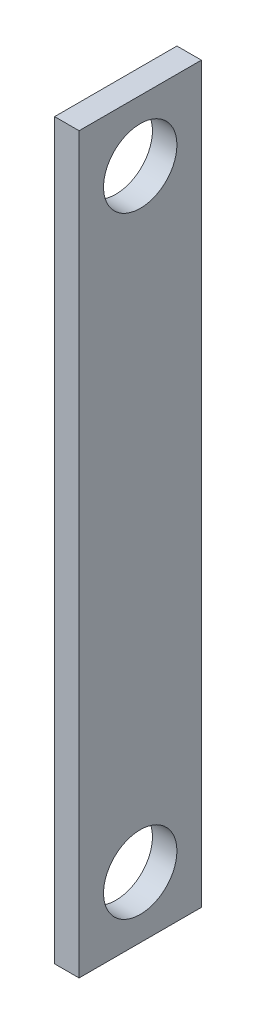
ISO-10303-21;
HEADER;
FILE_DESCRIPTION(('STEP AP214'),'2;1');
FILE_NAME('part.step','',(''),(''),'','','');
FILE_SCHEMA(('AUTOMOTIVE_DESIGN { 1 0 10303 214 1 1 1 1 }'));
ENDSEC;
DATA;
#1=APPLICATION_CONTEXT('core data for automotive mechanical design processes');
#2=APPLICATION_PROTOCOL_DEFINITION('international standard','automotive_design',2000,#1);
#3=PRODUCT_CONTEXT('',#1,'mechanical');
#4=PRODUCT('Part','Part','',(#3));
#5=PRODUCT_RELATED_PRODUCT_CATEGORY('part','',(#4));
#6=PRODUCT_DEFINITION_FORMATION('','',#4);
#7=PRODUCT_DEFINITION_CONTEXT('part definition',#1,'design');
#8=PRODUCT_DEFINITION('design','',#6,#7);
#9=PRODUCT_DEFINITION_SHAPE('','',#8);
#10=(LENGTH_UNIT() NAMED_UNIT(*) SI_UNIT(.MILLI.,.METRE.));
#11=(NAMED_UNIT(*) PLANE_ANGLE_UNIT() SI_UNIT($,.RADIAN.));
#12=(NAMED_UNIT(*) SI_UNIT($,.STERADIAN.) SOLID_ANGLE_UNIT());
#13=UNCERTAINTY_MEASURE_WITH_UNIT(LENGTH_MEASURE(1.E-05),#10,'distance_accuracy_value','');
#14=(GEOMETRIC_REPRESENTATION_CONTEXT(3) GLOBAL_UNCERTAINTY_ASSIGNED_CONTEXT((#13)) GLOBAL_UNIT_ASSIGNED_CONTEXT((#10,
#11,#12)) REPRESENTATION_CONTEXT('',''));
#15=CARTESIAN_POINT('',(0.,0.,0.));
#16=DIRECTION('',(0.,0.,1.));
#17=DIRECTION('',(1.,0.,0.));
#18=AXIS2_PLACEMENT_3D('',#15,#16,#17);
#19=CARTESIAN_POINT('',(2.,-30.,-5.));
#20=DIRECTION('',(0.,0.,1.));
#21=DIRECTION('',(1.,0.,0.));
#22=AXIS2_PLACEMENT_3D('',#19,#20,#21);
#23=PLANE('',#22);
#24=DIRECTION('',(0.,1.,0.));
#25=VECTOR('',#24,1.);
#26=CARTESIAN_POINT('',(0.,-30.,-5.));
#27=LINE('',#26,#25);
#28=CARTESIAN_POINT('',(0.,-30.,-5.));
#29=VERTEX_POINT('',#28);
#30=CARTESIAN_POINT('',(0.,30.,-5.));
#31=VERTEX_POINT('',#30);
#32=EDGE_CURVE('E96',#29,#31,#27,.T.);
#33=ORIENTED_EDGE('',*,*,#32,.T.);
#34=DIRECTION('',(-1.,0.,0.));
#35=VECTOR('',#34,1.);
#36=CARTESIAN_POINT('',(2.,30.,-5.));
#37=LINE('',#36,#35);
#38=CARTESIAN_POINT('',(2.,30.,-5.));
#39=VERTEX_POINT('',#38);
#40=EDGE_CURVE('E11',#39,#31,#37,.T.);
#41=ORIENTED_EDGE('',*,*,#40,.F.);
#42=DIRECTION('',(0.,1.,0.));
#43=VECTOR('',#42,1.);
#44=CARTESIAN_POINT('',(2.,-30.,-5.));
#45=LINE('',#44,#43);
#46=CARTESIAN_POINT('',(2.,-30.,-5.));
#47=VERTEX_POINT('',#46);
#48=EDGE_CURVE('E84',#47,#39,#45,.T.);
#49=ORIENTED_EDGE('',*,*,#48,.F.);
#50=DIRECTION('',(-1.,0.,0.));
#51=VECTOR('',#50,1.);
#52=CARTESIAN_POINT('',(2.,-30.,-5.));
#53=LINE('',#52,#51);
#54=EDGE_CURVE('E92',#47,#29,#53,.T.);
#55=ORIENTED_EDGE('',*,*,#54,.T.);
#56=EDGE_LOOP('',(#33,#41,#49,#55));
#57=FACE_BOUND('',#56,.T.);
#58=ADVANCED_FACE('F33',(#57),#23,.F.);
#59=CARTESIAN_POINT('',(2.,30.,5.));
#60=DIRECTION('',(0.,-1.,0.));
#61=DIRECTION('',(0.,0.,-1.));
#62=AXIS2_PLACEMENT_3D('',#59,#60,#61);
#63=PLANE('',#62);
#64=DIRECTION('',(0.,0.,1.));
#65=VECTOR('',#64,1.);
#66=CARTESIAN_POINT('',(0.,30.,5.));
#67=LINE('',#66,#65);
#68=CARTESIAN_POINT('',(0.,30.,5.));
#69=VERTEX_POINT('',#68);
#70=EDGE_CURVE('E88',#31,#69,#67,.T.);
#71=ORIENTED_EDGE('',*,*,#70,.T.);
#72=DIRECTION('',(-1.,0.,0.));
#73=VECTOR('',#72,1.);
#74=CARTESIAN_POINT('',(2.,30.,5.));
#75=LINE('',#74,#73);
#76=CARTESIAN_POINT('',(2.,30.,5.));
#77=VERTEX_POINT('',#76);
#78=EDGE_CURVE('E41',#77,#69,#75,.T.);
#79=ORIENTED_EDGE('',*,*,#78,.F.);
#80=DIRECTION('',(0.,0.,1.));
#81=VECTOR('',#80,1.);
#82=CARTESIAN_POINT('',(2.,30.,5.));
#83=LINE('',#82,#81);
#84=EDGE_CURVE('E79',#39,#77,#83,.T.);
#85=ORIENTED_EDGE('',*,*,#84,.F.);
#86=ORIENTED_EDGE('',*,*,#40,.T.);
#87=EDGE_LOOP('',(#71,#79,#85,#86));
#88=FACE_BOUND('',#87,.T.);
#89=ADVANCED_FACE('F87',(#88),#63,.F.);
#90=CARTESIAN_POINT('',(2.,-30.,5.));
#91=DIRECTION('',(0.,0.,-1.));
#92=DIRECTION('',(-1.,0.,0.));
#93=AXIS2_PLACEMENT_3D('',#90,#91,#92);
#94=PLANE('',#93);
#95=DIRECTION('',(0.,-1.,0.));
#96=VECTOR('',#95,1.);
#97=CARTESIAN_POINT('',(0.,-30.,5.));
#98=LINE('',#97,#96);
#99=CARTESIAN_POINT('',(0.,-30.,5.));
#100=VERTEX_POINT('',#99);
#101=EDGE_CURVE('E66',#69,#100,#98,.T.);
#102=ORIENTED_EDGE('',*,*,#101,.T.);
#103=DIRECTION('',(-1.,0.,0.));
#104=VECTOR('',#103,1.);
#105=CARTESIAN_POINT('',(2.,-30.,5.));
#106=LINE('',#105,#104);
#107=CARTESIAN_POINT('',(2.,-30.,5.));
#108=VERTEX_POINT('',#107);
#109=EDGE_CURVE('E89',#108,#100,#106,.T.);
#110=ORIENTED_EDGE('',*,*,#109,.F.);
#111=DIRECTION('',(0.,-1.,0.));
#112=VECTOR('',#111,1.);
#113=CARTESIAN_POINT('',(2.,-30.,5.));
#114=LINE('',#113,#112);
#115=EDGE_CURVE('E82',#77,#108,#114,.T.);
#116=ORIENTED_EDGE('',*,*,#115,.F.);
#117=ORIENTED_EDGE('',*,*,#78,.T.);
#118=EDGE_LOOP('',(#102,#110,#116,#117));
#119=FACE_BOUND('',#118,.T.);
#120=ADVANCED_FACE('F90',(#119),#94,.F.);
#121=CARTESIAN_POINT('',(2.,-30.,5.));
#122=DIRECTION('',(0.,1.,0.));
#123=DIRECTION('',(0.,0.,1.));
#124=AXIS2_PLACEMENT_3D('',#121,#122,#123);
#125=PLANE('',#124);
#126=DIRECTION('',(0.,0.,-1.));
#127=VECTOR('',#126,1.);
#128=CARTESIAN_POINT('',(0.,-30.,5.));
#129=LINE('',#128,#127);
#130=EDGE_CURVE('E72',#100,#29,#129,.T.);
#131=ORIENTED_EDGE('',*,*,#130,.T.);
#132=ORIENTED_EDGE('',*,*,#54,.F.);
#133=DIRECTION('',(0.,0.,-1.));
#134=VECTOR('',#133,1.);
#135=CARTESIAN_POINT('',(2.,-30.,5.));
#136=LINE('',#135,#134);
#137=EDGE_CURVE('E49',#108,#47,#136,.T.);
#138=ORIENTED_EDGE('',*,*,#137,.F.);
#139=ORIENTED_EDGE('',*,*,#109,.T.);
#140=EDGE_LOOP('',(#131,#132,#138,#139));
#141=FACE_BOUND('',#140,.T.);
#142=ADVANCED_FACE('F104',(#141),#125,.F.);
#143=CARTESIAN_POINT('',(2.,0.,0.));
#144=DIRECTION('',(-1.,0.,0.));
#145=DIRECTION('',(0.,0.,1.));
#146=AXIS2_PLACEMENT_3D('',#143,#144,#145);
#147=PLANE('',#146);
#148=CARTESIAN_POINT('',(2.,25.,0.));
#149=DIRECTION('',(1.,0.,0.));
#150=DIRECTION('',(0.,0.,-1.));
#151=AXIS2_PLACEMENT_3D('',#148,#149,#150);
#152=CIRCLE('',#151,3.);
#153=CARTESIAN_POINT('',(2.,25.,-3.));
#154=VERTEX_POINT('',#153);
#155=EDGE_CURVE('E118',#154,#154,#152,.T.);
#156=ORIENTED_EDGE('',*,*,#155,.F.);
#157=EDGE_LOOP('',(#156));
#158=FACE_BOUND('',#157,.T.);
#159=CARTESIAN_POINT('',(2.,-25.,0.));
#160=DIRECTION('',(1.,0.,0.));
#161=DIRECTION('',(0.,0.,-1.));
#162=AXIS2_PLACEMENT_3D('',#159,#160,#161);
#163=CIRCLE('',#162,3.);
#164=CARTESIAN_POINT('',(2.,-25.,-3.));
#165=VERTEX_POINT('',#164);
#166=EDGE_CURVE('E112',#165,#165,#163,.T.);
#167=ORIENTED_EDGE('',*,*,#166,.F.);
#168=EDGE_LOOP('',(#167));
#169=FACE_BOUND('',#168,.T.);
#170=ORIENTED_EDGE('',*,*,#48,.T.);
#171=ORIENTED_EDGE('',*,*,#84,.T.);
#172=ORIENTED_EDGE('',*,*,#115,.T.);
#173=ORIENTED_EDGE('',*,*,#137,.T.);
#174=EDGE_LOOP('',(#170,#171,#172,#173));
#175=FACE_BOUND('',#174,.T.);
#176=ADVANCED_FACE('F80',(#158,#169,#175),#147,.F.);
#177=CARTESIAN_POINT('',(0.,0.,0.));
#178=DIRECTION('',(-1.,0.,0.));
#179=DIRECTION('',(0.,0.,1.));
#180=AXIS2_PLACEMENT_3D('',#177,#178,#179);
#181=PLANE('',#180);
#182=CARTESIAN_POINT('',(0.,25.,0.));
#183=DIRECTION('',(-1.,0.,0.));
#184=DIRECTION('',(0.,0.,1.));
#185=AXIS2_PLACEMENT_3D('',#182,#183,#184);
#186=CIRCLE('',#185,3.);
#187=CARTESIAN_POINT('',(0.,25.,3.));
#188=VERTEX_POINT('',#187);
#189=EDGE_CURVE('E115',#188,#188,#186,.F.);
#190=ORIENTED_EDGE('',*,*,#189,.T.);
#191=EDGE_LOOP('',(#190));
#192=FACE_BOUND('',#191,.T.);
#193=CARTESIAN_POINT('',(0.,-25.,0.));
#194=DIRECTION('',(-1.,0.,0.));
#195=DIRECTION('',(0.,0.,1.));
#196=AXIS2_PLACEMENT_3D('',#193,#194,#195);
#197=CIRCLE('',#196,3.);
#198=CARTESIAN_POINT('',(0.,-25.,3.));
#199=VERTEX_POINT('',#198);
#200=EDGE_CURVE('E99',#199,#199,#197,.F.);
#201=ORIENTED_EDGE('',*,*,#200,.T.);
#202=EDGE_LOOP('',(#201));
#203=FACE_BOUND('',#202,.T.);
#204=ORIENTED_EDGE('',*,*,#32,.F.);
#205=ORIENTED_EDGE('',*,*,#130,.F.);
#206=ORIENTED_EDGE('',*,*,#101,.F.);
#207=ORIENTED_EDGE('',*,*,#70,.F.);
#208=EDGE_LOOP('',(#204,#205,#206,#207));
#209=FACE_BOUND('',#208,.T.);
#210=ADVANCED_FACE('F107',(#192,#203,#209),#181,.T.);
#211=CARTESIAN_POINT('',(-8.48528137423857,-25.,0.));
#212=DIRECTION('',(1.,0.,0.));
#213=DIRECTION('',(0.,0.,-1.));
#214=AXIS2_PLACEMENT_3D('',#211,#212,#213);
#215=CYLINDRICAL_SURFACE('',#214,3.);
#216=ORIENTED_EDGE('',*,*,#166,.T.);
#217=EDGE_LOOP('',(#216));
#218=FACE_BOUND('',#217,.T.);
#219=ORIENTED_EDGE('',*,*,#200,.F.);
#220=EDGE_LOOP('',(#219));
#221=FACE_BOUND('',#220,.T.);
#222=ADVANCED_FACE('F130',(#218,#221),#215,.F.);
#223=CARTESIAN_POINT('',(-8.48528137423857,25.,0.));
#224=DIRECTION('',(1.,0.,0.));
#225=DIRECTION('',(0.,0.,-1.));
#226=AXIS2_PLACEMENT_3D('',#223,#224,#225);
#227=CYLINDRICAL_SURFACE('',#226,3.);
#228=ORIENTED_EDGE('',*,*,#155,.T.);
#229=EDGE_LOOP('',(#228));
#230=FACE_BOUND('',#229,.T.);
#231=ORIENTED_EDGE('',*,*,#189,.F.);
#232=EDGE_LOOP('',(#231));
#233=FACE_BOUND('',#232,.T.);
#234=ADVANCED_FACE('F122',(#230,#233),#227,.F.);
#235=CLOSED_SHELL('',(#58,#89,#120,#142,#176,#210,#222,#234));
#236=MANIFOLD_SOLID_BREP('B2',#235);
#237=ADVANCED_BREP_SHAPE_REPRESENTATION('',(#18,#236),#14);
#238=SHAPE_DEFINITION_REPRESENTATION(#9,#237);
ENDSEC;
END-ISO-10303-21;
